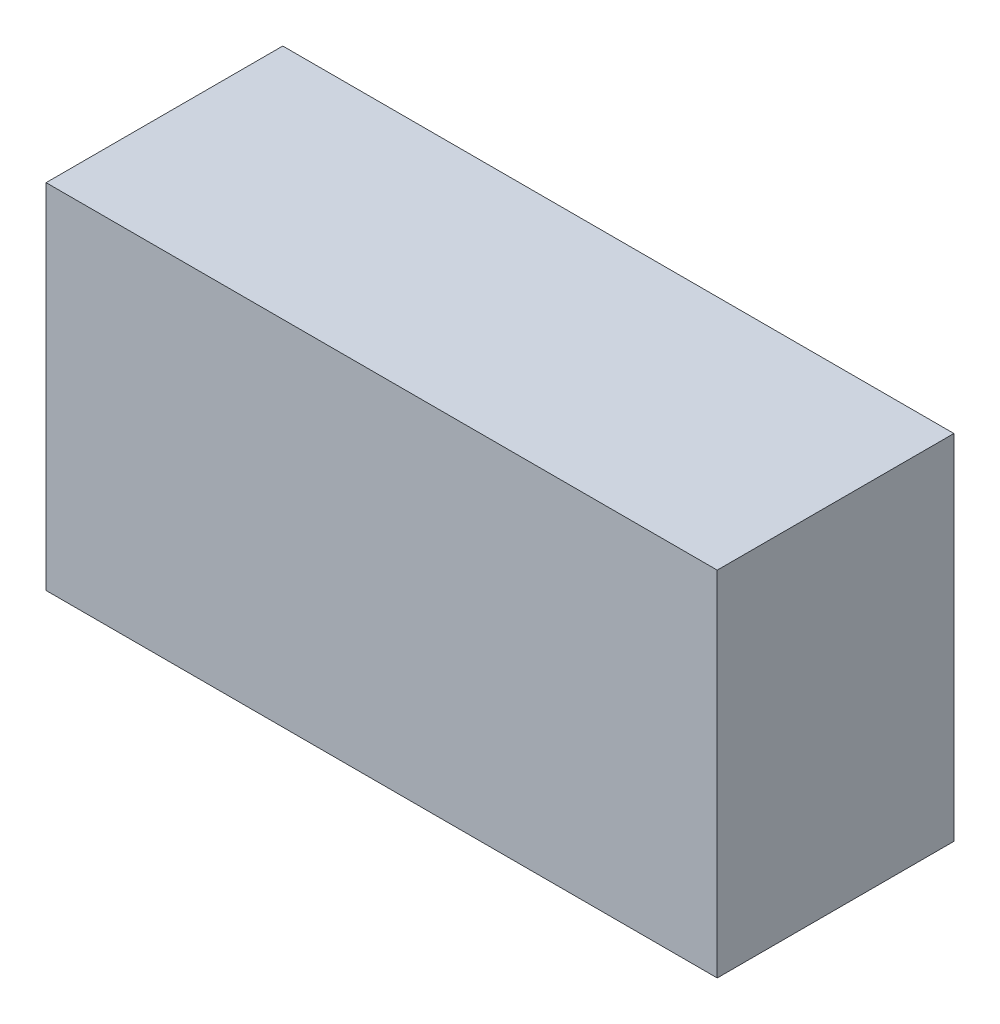
ISO-10303-21;
HEADER;
FILE_DESCRIPTION(('STEP AP214'),'2;1');
FILE_NAME('part.step','',(''),(''),'','','');
FILE_SCHEMA(('AUTOMOTIVE_DESIGN { 1 0 10303 214 1 1 1 1 }'));
ENDSEC;
DATA;
#1=APPLICATION_CONTEXT('core data for automotive mechanical design processes');
#2=APPLICATION_PROTOCOL_DEFINITION('international standard','automotive_design',2000,#1);
#3=PRODUCT_CONTEXT('',#1,'mechanical');
#4=PRODUCT('Part','Part','',(#3));
#5=PRODUCT_RELATED_PRODUCT_CATEGORY('part','',(#4));
#6=PRODUCT_DEFINITION_FORMATION('','',#4);
#7=PRODUCT_DEFINITION_CONTEXT('part definition',#1,'design');
#8=PRODUCT_DEFINITION('design','',#6,#7);
#9=PRODUCT_DEFINITION_SHAPE('','',#8);
#10=(LENGTH_UNIT() NAMED_UNIT(*) SI_UNIT(.MILLI.,.METRE.));
#11=(NAMED_UNIT(*) PLANE_ANGLE_UNIT() SI_UNIT($,.RADIAN.));
#12=(NAMED_UNIT(*) SI_UNIT($,.STERADIAN.) SOLID_ANGLE_UNIT());
#13=UNCERTAINTY_MEASURE_WITH_UNIT(LENGTH_MEASURE(1.E-05),#10,'distance_accuracy_value','');
#14=(GEOMETRIC_REPRESENTATION_CONTEXT(3) GLOBAL_UNCERTAINTY_ASSIGNED_CONTEXT((#13)) GLOBAL_UNIT_ASSIGNED_CONTEXT((#10,
#11,#12)) REPRESENTATION_CONTEXT('',''));
#15=CARTESIAN_POINT('',(0.,0.,0.));
#16=DIRECTION('',(0.,0.,1.));
#17=DIRECTION('',(1.,0.,0.));
#18=AXIS2_PLACEMENT_3D('',#15,#16,#17);
#19=CARTESIAN_POINT('',(0.,0.,17.018));
#20=DIRECTION('',(1.,0.,0.));
#21=DIRECTION('',(0.,1.,0.));
#22=AXIS2_PLACEMENT_3D('',#19,#20,#21);
#23=PLANE('',#22);
#24=DIRECTION('',(0.,-1.,0.));
#25=VECTOR('',#24,1.);
#26=CARTESIAN_POINT('',(0.,0.,0.));
#27=LINE('',#26,#25);
#28=CARTESIAN_POINT('',(0.,25.4,0.));
#29=VERTEX_POINT('',#28);
#30=CARTESIAN_POINT('',(0.,0.,0.));
#31=VERTEX_POINT('',#30);
#32=EDGE_CURVE('E100',#29,#31,#27,.T.);
#33=ORIENTED_EDGE('',*,*,#32,.T.);
#34=DIRECTION('',(0.,0.,-1.));
#35=VECTOR('',#34,1.);
#36=CARTESIAN_POINT('',(0.,0.,17.018));
#37=LINE('',#36,#35);
#38=CARTESIAN_POINT('',(0.,0.,17.018));
#39=VERTEX_POINT('',#38);
#40=EDGE_CURVE('E11',#39,#31,#37,.T.);
#41=ORIENTED_EDGE('',*,*,#40,.F.);
#42=DIRECTION('',(0.,-1.,0.));
#43=VECTOR('',#42,1.);
#44=CARTESIAN_POINT('',(0.,0.,17.018));
#45=LINE('',#44,#43);
#46=CARTESIAN_POINT('',(0.,25.4,17.018));
#47=VERTEX_POINT('',#46);
#48=EDGE_CURVE('E88',#47,#39,#45,.T.);
#49=ORIENTED_EDGE('',*,*,#48,.F.);
#50=DIRECTION('',(0.,0.,-1.));
#51=VECTOR('',#50,1.);
#52=CARTESIAN_POINT('',(0.,25.4,17.018));
#53=LINE('',#52,#51);
#54=EDGE_CURVE('E96',#47,#29,#53,.T.);
#55=ORIENTED_EDGE('',*,*,#54,.T.);
#56=EDGE_LOOP('',(#33,#41,#49,#55));
#57=FACE_BOUND('',#56,.T.);
#58=ADVANCED_FACE('F37',(#57),#23,.F.);
#59=CARTESIAN_POINT('',(0.,0.,17.018));
#60=DIRECTION('',(0.,1.,0.));
#61=DIRECTION('',(0.,0.,1.));
#62=AXIS2_PLACEMENT_3D('',#59,#60,#61);
#63=PLANE('',#62);
#64=DIRECTION('',(1.,0.,0.));
#65=VECTOR('',#64,1.);
#66=CARTESIAN_POINT('',(0.,0.,0.));
#67=LINE('',#66,#65);
#68=CARTESIAN_POINT('',(48.26,0.,0.));
#69=VERTEX_POINT('',#68);
#70=EDGE_CURVE('E92',#31,#69,#67,.T.);
#71=ORIENTED_EDGE('',*,*,#70,.T.);
#72=DIRECTION('',(0.,0.,-1.));
#73=VECTOR('',#72,1.);
#74=CARTESIAN_POINT('',(48.26,0.,17.018));
#75=LINE('',#74,#73);
#76=CARTESIAN_POINT('',(48.26,0.,17.018));
#77=VERTEX_POINT('',#76);
#78=EDGE_CURVE('E45',#77,#69,#75,.T.);
#79=ORIENTED_EDGE('',*,*,#78,.F.);
#80=DIRECTION('',(1.,0.,0.));
#81=VECTOR('',#80,1.);
#82=CARTESIAN_POINT('',(0.,0.,17.018));
#83=LINE('',#82,#81);
#84=EDGE_CURVE('E83',#39,#77,#83,.T.);
#85=ORIENTED_EDGE('',*,*,#84,.F.);
#86=ORIENTED_EDGE('',*,*,#40,.T.);
#87=EDGE_LOOP('',(#71,#79,#85,#86));
#88=FACE_BOUND('',#87,.T.);
#89=ADVANCED_FACE('F91',(#88),#63,.F.);
#90=CARTESIAN_POINT('',(48.26,0.,17.018));
#91=DIRECTION('',(-1.,0.,0.));
#92=DIRECTION('',(0.,-1.,0.));
#93=AXIS2_PLACEMENT_3D('',#90,#91,#92);
#94=PLANE('',#93);
#95=DIRECTION('',(0.,1.,0.));
#96=VECTOR('',#95,1.);
#97=CARTESIAN_POINT('',(48.26,0.,0.));
#98=LINE('',#97,#96);
#99=CARTESIAN_POINT('',(48.26,25.4,0.));
#100=VERTEX_POINT('',#99);
#101=EDGE_CURVE('E70',#69,#100,#98,.T.);
#102=ORIENTED_EDGE('',*,*,#101,.T.);
#103=DIRECTION('',(0.,0.,-1.));
#104=VECTOR('',#103,1.);
#105=CARTESIAN_POINT('',(48.26,25.4,17.018));
#106=LINE('',#105,#104);
#107=CARTESIAN_POINT('',(48.26,25.4,17.018));
#108=VERTEX_POINT('',#107);
#109=EDGE_CURVE('E93',#108,#100,#106,.T.);
#110=ORIENTED_EDGE('',*,*,#109,.F.);
#111=DIRECTION('',(0.,1.,0.));
#112=VECTOR('',#111,1.);
#113=CARTESIAN_POINT('',(48.26,0.,17.018));
#114=LINE('',#113,#112);
#115=EDGE_CURVE('E86',#77,#108,#114,.T.);
#116=ORIENTED_EDGE('',*,*,#115,.F.);
#117=ORIENTED_EDGE('',*,*,#78,.T.);
#118=EDGE_LOOP('',(#102,#110,#116,#117));
#119=FACE_BOUND('',#118,.T.);
#120=ADVANCED_FACE('F94',(#119),#94,.F.);
#121=CARTESIAN_POINT('',(0.,25.4,17.018));
#122=DIRECTION('',(0.,-1.,0.));
#123=DIRECTION('',(0.,0.,-1.));
#124=AXIS2_PLACEMENT_3D('',#121,#122,#123);
#125=PLANE('',#124);
#126=DIRECTION('',(-1.,0.,0.));
#127=VECTOR('',#126,1.);
#128=CARTESIAN_POINT('',(0.,25.4,0.));
#129=LINE('',#128,#127);
#130=EDGE_CURVE('E76',#100,#29,#129,.T.);
#131=ORIENTED_EDGE('',*,*,#130,.T.);
#132=ORIENTED_EDGE('',*,*,#54,.F.);
#133=DIRECTION('',(-1.,0.,0.));
#134=VECTOR('',#133,1.);
#135=CARTESIAN_POINT('',(0.,25.4,17.018));
#136=LINE('',#135,#134);
#137=EDGE_CURVE('E53',#108,#47,#136,.T.);
#138=ORIENTED_EDGE('',*,*,#137,.F.);
#139=ORIENTED_EDGE('',*,*,#109,.T.);
#140=EDGE_LOOP('',(#131,#132,#138,#139));
#141=FACE_BOUND('',#140,.T.);
#142=ADVANCED_FACE('F107',(#141),#125,.F.);
#143=CARTESIAN_POINT('',(0.,0.,17.018));
#144=DIRECTION('',(0.,0.,-1.));
#145=DIRECTION('',(-1.,0.,0.));
#146=AXIS2_PLACEMENT_3D('',#143,#144,#145);
#147=PLANE('',#146);
#148=ORIENTED_EDGE('',*,*,#48,.T.);
#149=ORIENTED_EDGE('',*,*,#84,.T.);
#150=ORIENTED_EDGE('',*,*,#115,.T.);
#151=ORIENTED_EDGE('',*,*,#137,.T.);
#152=EDGE_LOOP('',(#148,#149,#150,#151));
#153=FACE_BOUND('',#152,.T.);
#154=ADVANCED_FACE('F84',(#153),#147,.F.);
#155=CARTESIAN_POINT('',(0.,0.,0.));
#156=DIRECTION('',(0.,0.,-1.));
#157=DIRECTION('',(-1.,0.,0.));
#158=AXIS2_PLACEMENT_3D('',#155,#156,#157);
#159=PLANE('',#158);
#160=ORIENTED_EDGE('',*,*,#32,.F.);
#161=ORIENTED_EDGE('',*,*,#130,.F.);
#162=ORIENTED_EDGE('',*,*,#101,.F.);
#163=ORIENTED_EDGE('',*,*,#70,.F.);
#164=EDGE_LOOP('',(#160,#161,#162,#163));
#165=FACE_BOUND('',#164,.T.);
#166=ADVANCED_FACE('F110',(#165),#159,.T.);
#167=CLOSED_SHELL('',(#58,#89,#120,#142,#154,#166));
#168=MANIFOLD_SOLID_BREP('B2',#167);
#169=ADVANCED_BREP_SHAPE_REPRESENTATION('',(#18,#168),#14);
#170=SHAPE_DEFINITION_REPRESENTATION(#9,#169);
ENDSEC;
END-ISO-10303-21;
